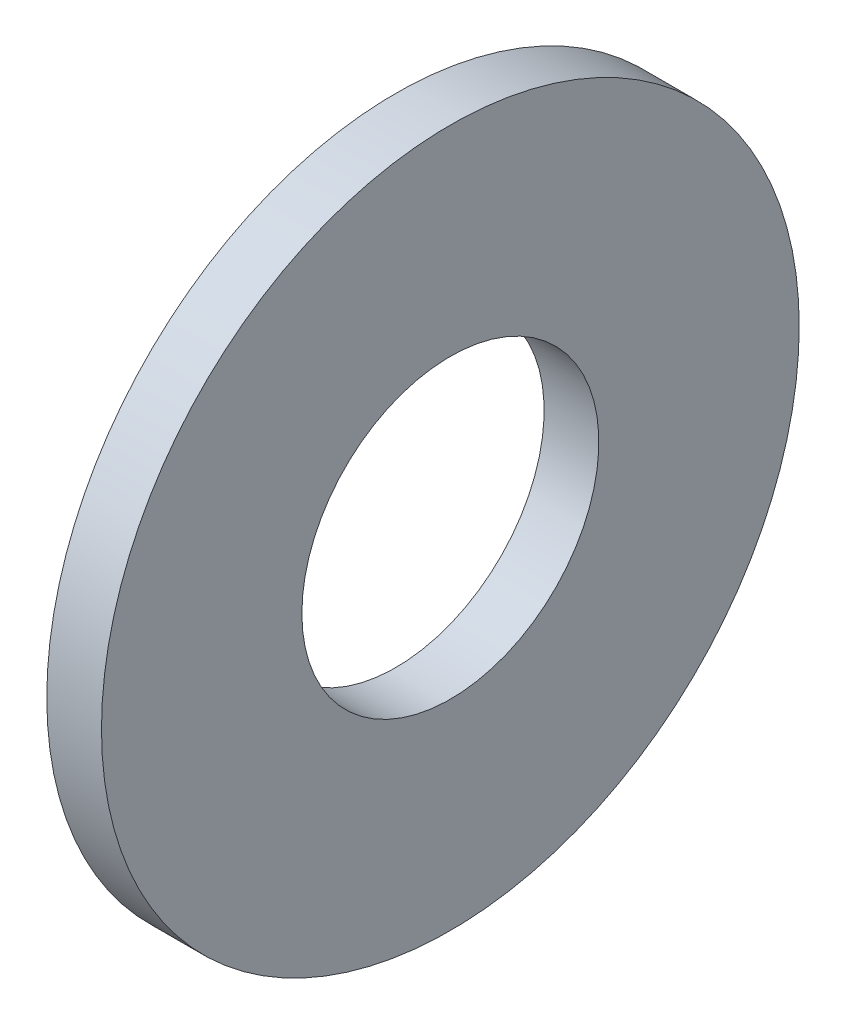
ISO-10303-21;
HEADER;
FILE_DESCRIPTION(('STEP AP214'),'2;1');
FILE_NAME('part.step','',(''),(''),'','','');
FILE_SCHEMA(('AUTOMOTIVE_DESIGN { 1 0 10303 214 1 1 1 1 }'));
ENDSEC;
DATA;
#1=APPLICATION_CONTEXT('core data for automotive mechanical design processes');
#2=APPLICATION_PROTOCOL_DEFINITION('international standard','automotive_design',2000,#1);
#3=PRODUCT_CONTEXT('',#1,'mechanical');
#4=PRODUCT('Part','Part','',(#3));
#5=PRODUCT_RELATED_PRODUCT_CATEGORY('part','',(#4));
#6=PRODUCT_DEFINITION_FORMATION('','',#4);
#7=PRODUCT_DEFINITION_CONTEXT('part definition',#1,'design');
#8=PRODUCT_DEFINITION('design','',#6,#7);
#9=PRODUCT_DEFINITION_SHAPE('','',#8);
#10=(LENGTH_UNIT() NAMED_UNIT(*) SI_UNIT(.MILLI.,.METRE.));
#11=(NAMED_UNIT(*) PLANE_ANGLE_UNIT() SI_UNIT($,.RADIAN.));
#12=(NAMED_UNIT(*) SI_UNIT($,.STERADIAN.) SOLID_ANGLE_UNIT());
#13=UNCERTAINTY_MEASURE_WITH_UNIT(LENGTH_MEASURE(1.E-05),#10,'distance_accuracy_value','');
#14=(GEOMETRIC_REPRESENTATION_CONTEXT(3) GLOBAL_UNCERTAINTY_ASSIGNED_CONTEXT((#13)) GLOBAL_UNIT_ASSIGNED_CONTEXT((#10,
#11,#12)) REPRESENTATION_CONTEXT('',''));
#15=CARTESIAN_POINT('',(0.,0.,0.));
#16=DIRECTION('',(0.,0.,1.));
#17=DIRECTION('',(1.,0.,0.));
#18=AXIS2_PLACEMENT_3D('',#15,#16,#17);
#19=CARTESIAN_POINT('',(-34.9249999999999,0.,0.));
#20=DIRECTION('',(-1.,0.,0.));
#21=DIRECTION('',(0.,0.,1.));
#22=AXIS2_PLACEMENT_3D('',#19,#20,#21);
#23=CYLINDRICAL_SURFACE('',#22,3.3782);
#24=CARTESIAN_POINT('',(0.,0.,0.));
#25=DIRECTION('',(-1.,0.,0.));
#26=DIRECTION('',(0.,0.,1.));
#27=AXIS2_PLACEMENT_3D('',#24,#25,#26);
#28=CIRCLE('',#27,3.3782);
#29=CARTESIAN_POINT('',(0.,0.,3.3782));
#30=VERTEX_POINT('',#29);
#31=EDGE_CURVE('E10',#30,#30,#28,.T.);
#32=ORIENTED_EDGE('',*,*,#31,.F.);
#33=EDGE_LOOP('',(#32));
#34=FACE_BOUND('',#33,.T.);
#35=CARTESIAN_POINT('',(-1.2446,0.,0.));
#36=DIRECTION('',(-1.,0.,0.));
#37=DIRECTION('',(0.,0.,1.));
#38=AXIS2_PLACEMENT_3D('',#35,#36,#37);
#39=CIRCLE('',#38,3.3782);
#40=CARTESIAN_POINT('',(-1.2446,0.,3.3782));
#41=VERTEX_POINT('',#40);
#42=EDGE_CURVE('E45',#41,#41,#39,.T.);
#43=ORIENTED_EDGE('',*,*,#42,.T.);
#44=EDGE_LOOP('',(#43));
#45=FACE_BOUND('',#44,.T.);
#46=ADVANCED_FACE('F31',(#34,#45),#23,.F.);
#47=CARTESIAN_POINT('',(0.,3.3782,0.));
#48=DIRECTION('',(-1.,0.,0.));
#49=DIRECTION('',(0.,0.,1.));
#50=AXIS2_PLACEMENT_3D('',#47,#48,#49);
#51=PLANE('',#50);
#52=CARTESIAN_POINT('',(0.,0.,0.));
#53=DIRECTION('',(-1.,0.,0.));
#54=DIRECTION('',(0.,0.,1.));
#55=AXIS2_PLACEMENT_3D('',#52,#53,#54);
#56=CIRCLE('',#55,7.9375);
#57=CARTESIAN_POINT('',(0.,0.,7.9375));
#58=VERTEX_POINT('',#57);
#59=EDGE_CURVE('E37',#58,#58,#56,.T.);
#60=ORIENTED_EDGE('',*,*,#59,.F.);
#61=EDGE_LOOP('',(#60));
#62=FACE_BOUND('',#61,.T.);
#63=ORIENTED_EDGE('',*,*,#31,.T.);
#64=EDGE_LOOP('',(#63));
#65=FACE_BOUND('',#64,.T.);
#66=ADVANCED_FACE('F60',(#62,#65),#51,.F.);
#67=CARTESIAN_POINT('',(-34.9249999999999,0.,0.));
#68=DIRECTION('',(-1.,0.,0.));
#69=DIRECTION('',(0.,0.,1.));
#70=AXIS2_PLACEMENT_3D('',#67,#68,#69);
#71=CYLINDRICAL_SURFACE('',#70,7.9375);
#72=CARTESIAN_POINT('',(-1.2446,0.,0.));
#73=DIRECTION('',(-1.,0.,0.));
#74=DIRECTION('',(0.,0.,1.));
#75=AXIS2_PLACEMENT_3D('',#72,#73,#74);
#76=CIRCLE('',#75,7.9375);
#77=CARTESIAN_POINT('',(-1.2446,0.,7.9375));
#78=VERTEX_POINT('',#77);
#79=EDGE_CURVE('E41',#78,#78,#76,.T.);
#80=ORIENTED_EDGE('',*,*,#79,.F.);
#81=EDGE_LOOP('',(#80));
#82=FACE_BOUND('',#81,.T.);
#83=ORIENTED_EDGE('',*,*,#59,.T.);
#84=EDGE_LOOP('',(#83));
#85=FACE_BOUND('',#84,.T.);
#86=ADVANCED_FACE('F55',(#82,#85),#71,.T.);
#87=CARTESIAN_POINT('',(-1.2446,7.9375,0.));
#88=DIRECTION('',(1.,0.,0.));
#89=DIRECTION('',(0.,0.,-1.));
#90=AXIS2_PLACEMENT_3D('',#87,#88,#89);
#91=PLANE('',#90);
#92=ORIENTED_EDGE('',*,*,#42,.F.);
#93=EDGE_LOOP('',(#92));
#94=FACE_BOUND('',#93,.T.);
#95=ORIENTED_EDGE('',*,*,#79,.T.);
#96=EDGE_LOOP('',(#95));
#97=FACE_BOUND('',#96,.T.);
#98=ADVANCED_FACE('F52',(#94,#97),#91,.F.);
#99=CLOSED_SHELL('',(#46,#66,#86,#98));
#100=MANIFOLD_SOLID_BREP('B2',#99);
#101=ADVANCED_BREP_SHAPE_REPRESENTATION('',(#18,#100),#14);
#102=SHAPE_DEFINITION_REPRESENTATION(#9,#101);
ENDSEC;
END-ISO-10303-21;
